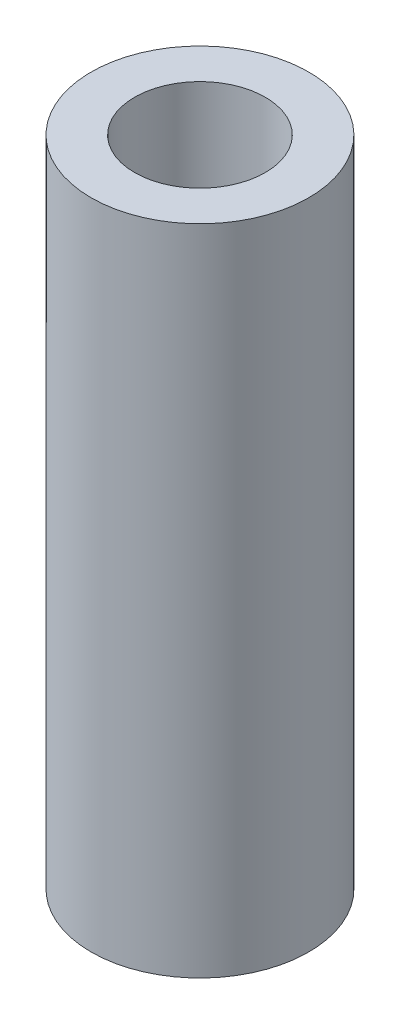
ISO-10303-21;
HEADER;
FILE_DESCRIPTION(('STEP AP214'),'2;1');
FILE_NAME('part.step','',(''),(''),'','','');
FILE_SCHEMA(('AUTOMOTIVE_DESIGN { 1 0 10303 214 1 1 1 1 }'));
ENDSEC;
DATA;
#1=APPLICATION_CONTEXT('core data for automotive mechanical design processes');
#2=APPLICATION_PROTOCOL_DEFINITION('international standard','automotive_design',2000,#1);
#3=PRODUCT_CONTEXT('',#1,'mechanical');
#4=PRODUCT('Part','Part','',(#3));
#5=PRODUCT_RELATED_PRODUCT_CATEGORY('part','',(#4));
#6=PRODUCT_DEFINITION_FORMATION('','',#4);
#7=PRODUCT_DEFINITION_CONTEXT('part definition',#1,'design');
#8=PRODUCT_DEFINITION('design','',#6,#7);
#9=PRODUCT_DEFINITION_SHAPE('','',#8);
#10=(LENGTH_UNIT() NAMED_UNIT(*) SI_UNIT(.MILLI.,.METRE.));
#11=(NAMED_UNIT(*) PLANE_ANGLE_UNIT() SI_UNIT($,.RADIAN.));
#12=(NAMED_UNIT(*) SI_UNIT($,.STERADIAN.) SOLID_ANGLE_UNIT());
#13=UNCERTAINTY_MEASURE_WITH_UNIT(LENGTH_MEASURE(1.E-05),#10,'distance_accuracy_value','');
#14=(GEOMETRIC_REPRESENTATION_CONTEXT(3) GLOBAL_UNCERTAINTY_ASSIGNED_CONTEXT((#13)) GLOBAL_UNIT_ASSIGNED_CONTEXT((#10,
#11,#12)) REPRESENTATION_CONTEXT('',''));
#15=CARTESIAN_POINT('',(0.,0.,0.));
#16=DIRECTION('',(0.,0.,1.));
#17=DIRECTION('',(1.,0.,0.));
#18=AXIS2_PLACEMENT_3D('',#15,#16,#17);
#19=CARTESIAN_POINT('',(0.,15.,0.));
#20=DIRECTION('',(0.,-1.,0.));
#21=DIRECTION('',(0.,0.,-1.));
#22=AXIS2_PLACEMENT_3D('',#19,#20,#21);
#23=CYLINDRICAL_SURFACE('',#22,1.5);
#24=CARTESIAN_POINT('',(0.,15.,0.));
#25=DIRECTION('',(0.,1.,0.));
#26=DIRECTION('',(0.,0.,1.));
#27=AXIS2_PLACEMENT_3D('',#24,#25,#26);
#28=CIRCLE('',#27,1.5);
#29=CARTESIAN_POINT('',(0.,15.,1.5));
#30=VERTEX_POINT('',#29);
#31=EDGE_CURVE('E53',#30,#30,#28,.T.);
#32=ORIENTED_EDGE('',*,*,#31,.T.);
#33=EDGE_LOOP('',(#32));
#34=FACE_BOUND('',#33,.T.);
#35=CARTESIAN_POINT('',(0.,0.,0.));
#36=DIRECTION('',(0.,1.,0.));
#37=DIRECTION('',(0.,0.,1.));
#38=AXIS2_PLACEMENT_3D('',#35,#36,#37);
#39=CIRCLE('',#38,1.5);
#40=CARTESIAN_POINT('',(0.,0.,1.5));
#41=VERTEX_POINT('',#40);
#42=EDGE_CURVE('E60',#41,#41,#39,.T.);
#43=ORIENTED_EDGE('',*,*,#42,.F.);
#44=EDGE_LOOP('',(#43));
#45=FACE_BOUND('',#44,.T.);
#46=ADVANCED_FACE('F45',(#34,#45),#23,.F.);
#47=CARTESIAN_POINT('',(0.,15.,0.));
#48=DIRECTION('',(0.,-1.,0.));
#49=DIRECTION('',(0.,0.,-1.));
#50=AXIS2_PLACEMENT_3D('',#47,#48,#49);
#51=CYLINDRICAL_SURFACE('',#50,2.5);
#52=CARTESIAN_POINT('',(0.,15.,0.));
#53=DIRECTION('',(0.,1.,0.));
#54=DIRECTION('',(0.,0.,1.));
#55=AXIS2_PLACEMENT_3D('',#52,#53,#54);
#56=CIRCLE('',#55,2.5);
#57=CARTESIAN_POINT('',(0.,15.,2.5));
#58=VERTEX_POINT('',#57);
#59=EDGE_CURVE('E10',#58,#58,#56,.T.);
#60=ORIENTED_EDGE('',*,*,#59,.F.);
#61=EDGE_LOOP('',(#60));
#62=FACE_BOUND('',#61,.T.);
#63=CARTESIAN_POINT('',(0.,0.,0.));
#64=DIRECTION('',(0.,1.,0.));
#65=DIRECTION('',(0.,0.,1.));
#66=AXIS2_PLACEMENT_3D('',#63,#64,#65);
#67=CIRCLE('',#66,2.5);
#68=CARTESIAN_POINT('',(0.,0.,2.5));
#69=VERTEX_POINT('',#68);
#70=EDGE_CURVE('E48',#69,#69,#67,.T.);
#71=ORIENTED_EDGE('',*,*,#70,.T.);
#72=EDGE_LOOP('',(#71));
#73=FACE_BOUND('',#72,.T.);
#74=ADVANCED_FACE('F69',(#62,#73),#51,.T.);
#75=CARTESIAN_POINT('',(0.,15.,0.));
#76=DIRECTION('',(0.,1.,0.));
#77=DIRECTION('',(0.,0.,1.));
#78=AXIS2_PLACEMENT_3D('',#75,#76,#77);
#79=PLANE('',#78);
#80=ORIENTED_EDGE('',*,*,#31,.F.);
#81=EDGE_LOOP('',(#80));
#82=FACE_BOUND('',#81,.T.);
#83=ORIENTED_EDGE('',*,*,#59,.T.);
#84=EDGE_LOOP('',(#83));
#85=FACE_BOUND('',#84,.T.);
#86=ADVANCED_FACE('F73',(#82,#85),#79,.T.);
#87=CARTESIAN_POINT('',(0.,0.,0.));
#88=DIRECTION('',(0.,1.,0.));
#89=DIRECTION('',(0.,0.,1.));
#90=AXIS2_PLACEMENT_3D('',#87,#88,#89);
#91=PLANE('',#90);
#92=ORIENTED_EDGE('',*,*,#42,.T.);
#93=EDGE_LOOP('',(#92));
#94=FACE_BOUND('',#93,.T.);
#95=ORIENTED_EDGE('',*,*,#70,.F.);
#96=EDGE_LOOP('',(#95));
#97=FACE_BOUND('',#96,.T.);
#98=ADVANCED_FACE('F71',(#94,#97),#91,.F.);
#99=CLOSED_SHELL('',(#46,#74,#86,#98));
#100=MANIFOLD_SOLID_BREP('B2',#99);
#101=ADVANCED_BREP_SHAPE_REPRESENTATION('',(#18,#100),#14);
#102=SHAPE_DEFINITION_REPRESENTATION(#9,#101);
ENDSEC;
END-ISO-10303-21;
